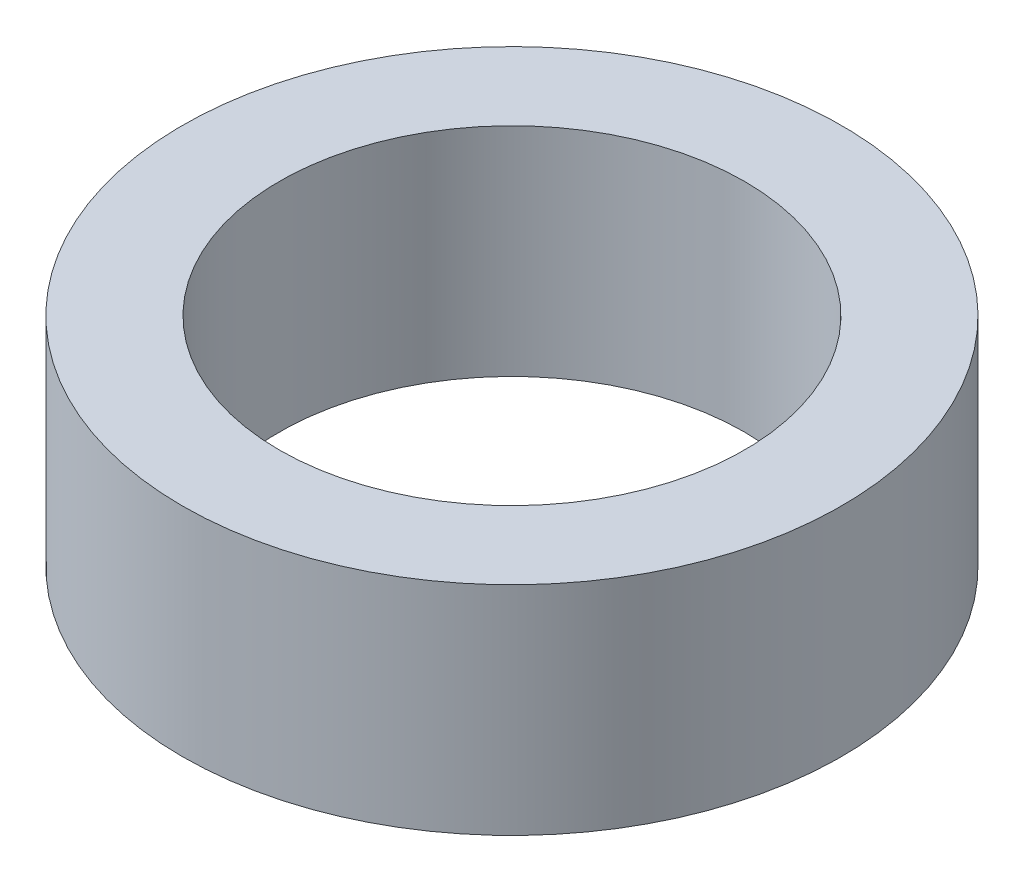
ISO-10303-21;
HEADER;
FILE_DESCRIPTION(('STEP AP214'),'2;1');
FILE_NAME('part.step','',(''),(''),'','','');
FILE_SCHEMA(('AUTOMOTIVE_DESIGN { 1 0 10303 214 1 1 1 1 }'));
ENDSEC;
DATA;
#1=APPLICATION_CONTEXT('core data for automotive mechanical design processes');
#2=APPLICATION_PROTOCOL_DEFINITION('international standard','automotive_design',2000,#1);
#3=PRODUCT_CONTEXT('',#1,'mechanical');
#4=PRODUCT('Part','Part','',(#3));
#5=PRODUCT_RELATED_PRODUCT_CATEGORY('part','',(#4));
#6=PRODUCT_DEFINITION_FORMATION('','',#4);
#7=PRODUCT_DEFINITION_CONTEXT('part definition',#1,'design');
#8=PRODUCT_DEFINITION('design','',#6,#7);
#9=PRODUCT_DEFINITION_SHAPE('','',#8);
#10=(LENGTH_UNIT() NAMED_UNIT(*) SI_UNIT(.MILLI.,.METRE.));
#11=(NAMED_UNIT(*) PLANE_ANGLE_UNIT() SI_UNIT($,.RADIAN.));
#12=(NAMED_UNIT(*) SI_UNIT($,.STERADIAN.) SOLID_ANGLE_UNIT());
#13=UNCERTAINTY_MEASURE_WITH_UNIT(LENGTH_MEASURE(1.E-05),#10,'distance_accuracy_value','');
#14=(GEOMETRIC_REPRESENTATION_CONTEXT(3) GLOBAL_UNCERTAINTY_ASSIGNED_CONTEXT((#13)) GLOBAL_UNIT_ASSIGNED_CONTEXT((#10,
#11,#12)) REPRESENTATION_CONTEXT('',''));
#15=CARTESIAN_POINT('',(0.,0.,0.));
#16=DIRECTION('',(0.,0.,1.));
#17=DIRECTION('',(1.,0.,0.));
#18=AXIS2_PLACEMENT_3D('',#15,#16,#17);
#19=CARTESIAN_POINT('',(0.,28.,0.));
#20=DIRECTION('',(0.,-1.,0.));
#21=DIRECTION('',(0.,0.,-1.));
#22=AXIS2_PLACEMENT_3D('',#19,#20,#21);
#23=CYLINDRICAL_SURFACE('',#22,42.5);
#24=CARTESIAN_POINT('',(0.,28.,0.));
#25=DIRECTION('',(0.,1.,0.));
#26=DIRECTION('',(0.,0.,1.));
#27=AXIS2_PLACEMENT_3D('',#24,#25,#26);
#28=CIRCLE('',#27,42.5);
#29=CARTESIAN_POINT('',(0.,28.,42.5));
#30=VERTEX_POINT('',#29);
#31=EDGE_CURVE('E10',#30,#30,#28,.T.);
#32=ORIENTED_EDGE('',*,*,#31,.F.);
#33=EDGE_LOOP('',(#32));
#34=FACE_BOUND('',#33,.T.);
#35=CARTESIAN_POINT('',(0.,0.,0.));
#36=DIRECTION('',(0.,1.,0.));
#37=DIRECTION('',(0.,0.,1.));
#38=AXIS2_PLACEMENT_3D('',#35,#36,#37);
#39=CIRCLE('',#38,42.5);
#40=CARTESIAN_POINT('',(0.,0.,42.5));
#41=VERTEX_POINT('',#40);
#42=EDGE_CURVE('E37',#41,#41,#39,.T.);
#43=ORIENTED_EDGE('',*,*,#42,.T.);
#44=EDGE_LOOP('',(#43));
#45=FACE_BOUND('',#44,.T.);
#46=ADVANCED_FACE('F40',(#34,#45),#23,.T.);
#47=CARTESIAN_POINT('',(0.,28.,0.));
#48=DIRECTION('',(0.,1.,0.));
#49=DIRECTION('',(0.,0.,1.));
#50=AXIS2_PLACEMENT_3D('',#47,#48,#49);
#51=PLANE('',#50);
#52=CARTESIAN_POINT('',(0.,28.,0.));
#53=DIRECTION('',(0.,1.,0.));
#54=DIRECTION('',(0.,0.,1.));
#55=AXIS2_PLACEMENT_3D('',#52,#53,#54);
#56=CIRCLE('',#55,30.);
#57=CARTESIAN_POINT('',(0.,28.,30.));
#58=VERTEX_POINT('',#57);
#59=EDGE_CURVE('E50',#58,#58,#56,.T.);
#60=ORIENTED_EDGE('',*,*,#59,.F.);
#61=EDGE_LOOP('',(#60));
#62=FACE_BOUND('',#61,.T.);
#63=ORIENTED_EDGE('',*,*,#31,.T.);
#64=EDGE_LOOP('',(#63));
#65=FACE_BOUND('',#64,.T.);
#66=ADVANCED_FACE('F59',(#62,#65),#51,.T.);
#67=CARTESIAN_POINT('',(0.,0.,0.));
#68=DIRECTION('',(0.,1.,0.));
#69=DIRECTION('',(0.,0.,1.));
#70=AXIS2_PLACEMENT_3D('',#67,#68,#69);
#71=PLANE('',#70);
#72=CARTESIAN_POINT('',(0.,0.,0.));
#73=DIRECTION('',(0.,1.,0.));
#74=DIRECTION('',(0.,0.,1.));
#75=AXIS2_PLACEMENT_3D('',#72,#73,#74);
#76=CIRCLE('',#75,30.);
#77=CARTESIAN_POINT('',(0.,0.,30.));
#78=VERTEX_POINT('',#77);
#79=EDGE_CURVE('E47',#78,#78,#76,.T.);
#80=ORIENTED_EDGE('',*,*,#79,.T.);
#81=EDGE_LOOP('',(#80));
#82=FACE_BOUND('',#81,.T.);
#83=ORIENTED_EDGE('',*,*,#42,.F.);
#84=EDGE_LOOP('',(#83));
#85=FACE_BOUND('',#84,.T.);
#86=ADVANCED_FACE('F58',(#82,#85),#71,.F.);
#87=CARTESIAN_POINT('',(0.,28.,0.));
#88=DIRECTION('',(0.,-1.,0.));
#89=DIRECTION('',(0.,0.,-1.));
#90=AXIS2_PLACEMENT_3D('',#87,#88,#89);
#91=CYLINDRICAL_SURFACE('',#90,30.);
#92=ORIENTED_EDGE('',*,*,#59,.T.);
#93=EDGE_LOOP('',(#92));
#94=FACE_BOUND('',#93,.T.);
#95=ORIENTED_EDGE('',*,*,#79,.F.);
#96=EDGE_LOOP('',(#95));
#97=FACE_BOUND('',#96,.T.);
#98=ADVANCED_FACE('F54',(#94,#97),#91,.F.);
#99=CLOSED_SHELL('',(#46,#66,#86,#98));
#100=MANIFOLD_SOLID_BREP('B2',#99);
#101=ADVANCED_BREP_SHAPE_REPRESENTATION('',(#18,#100),#14);
#102=SHAPE_DEFINITION_REPRESENTATION(#9,#101);
ENDSEC;
END-ISO-10303-21;
